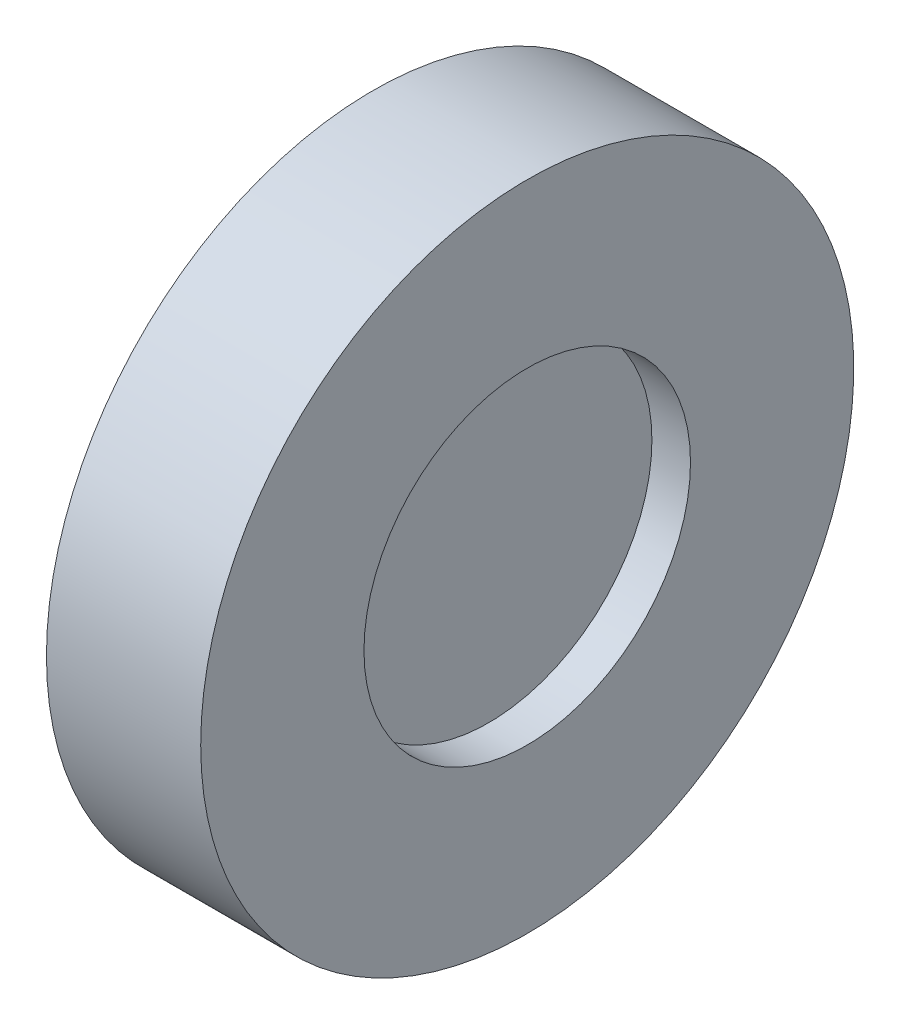
ISO-10303-21;
HEADER;
FILE_DESCRIPTION(('STEP AP214'),'2;1');
FILE_NAME('part.step','',(''),(''),'','','');
FILE_SCHEMA(('AUTOMOTIVE_DESIGN { 1 0 10303 214 1 1 1 1 }'));
ENDSEC;
DATA;
#1=APPLICATION_CONTEXT('core data for automotive mechanical design processes');
#2=APPLICATION_PROTOCOL_DEFINITION('international standard','automotive_design',2000,#1);
#3=PRODUCT_CONTEXT('',#1,'mechanical');
#4=PRODUCT('Part','Part','',(#3));
#5=PRODUCT_RELATED_PRODUCT_CATEGORY('part','',(#4));
#6=PRODUCT_DEFINITION_FORMATION('','',#4);
#7=PRODUCT_DEFINITION_CONTEXT('part definition',#1,'design');
#8=PRODUCT_DEFINITION('design','',#6,#7);
#9=PRODUCT_DEFINITION_SHAPE('','',#8);
#10=(LENGTH_UNIT() NAMED_UNIT(*) SI_UNIT(.MILLI.,.METRE.));
#11=(NAMED_UNIT(*) PLANE_ANGLE_UNIT() SI_UNIT($,.RADIAN.));
#12=(NAMED_UNIT(*) SI_UNIT($,.STERADIAN.) SOLID_ANGLE_UNIT());
#13=UNCERTAINTY_MEASURE_WITH_UNIT(LENGTH_MEASURE(1.E-05),#10,'distance_accuracy_value','');
#14=(GEOMETRIC_REPRESENTATION_CONTEXT(3) GLOBAL_UNCERTAINTY_ASSIGNED_CONTEXT((#13)) GLOBAL_UNIT_ASSIGNED_CONTEXT((#10,
#11,#12)) REPRESENTATION_CONTEXT('',''));
#15=CARTESIAN_POINT('',(0.,0.,0.));
#16=DIRECTION('',(0.,0.,1.));
#17=DIRECTION('',(1.,0.,0.));
#18=AXIS2_PLACEMENT_3D('',#15,#16,#17);
#19=CARTESIAN_POINT('',(1.5,6.35,0.));
#20=DIRECTION('',(-1.,0.,0.));
#21=DIRECTION('',(0.,0.,1.));
#22=AXIS2_PLACEMENT_3D('',#19,#20,#21);
#23=PLANE('',#22);
#24=CARTESIAN_POINT('',(1.5,0.,0.));
#25=DIRECTION('',(-1.,0.,0.));
#26=DIRECTION('',(0.,0.,1.));
#27=AXIS2_PLACEMENT_3D('',#24,#25,#26);
#28=CIRCLE('',#27,6.35);
#29=CARTESIAN_POINT('',(1.5,0.,6.35));
#30=VERTEX_POINT('',#29);
#31=EDGE_CURVE('E10',#30,#30,#28,.T.);
#32=ORIENTED_EDGE('',*,*,#31,.F.);
#33=EDGE_LOOP('',(#32));
#34=FACE_BOUND('',#33,.T.);
#35=ADVANCED_FACE('F37',(#34),#23,.F.);
#36=CARTESIAN_POINT('',(-1.61421241885762,0.,0.));
#37=DIRECTION('',(-1.,0.,0.));
#38=DIRECTION('',(0.,0.,1.));
#39=AXIS2_PLACEMENT_3D('',#36,#37,#38);
#40=CYLINDRICAL_SURFACE('',#39,6.35);
#41=CARTESIAN_POINT('',(3.,0.,0.));
#42=DIRECTION('',(-1.,0.,0.));
#43=DIRECTION('',(0.,0.,1.));
#44=AXIS2_PLACEMENT_3D('',#41,#42,#43);
#45=CIRCLE('',#44,6.35);
#46=CARTESIAN_POINT('',(3.,0.,6.35));
#47=VERTEX_POINT('',#46);
#48=EDGE_CURVE('E60',#47,#47,#45,.T.);
#49=ORIENTED_EDGE('',*,*,#48,.F.);
#50=EDGE_LOOP('',(#49));
#51=FACE_BOUND('',#50,.T.);
#52=ORIENTED_EDGE('',*,*,#31,.T.);
#53=EDGE_LOOP('',(#52));
#54=FACE_BOUND('',#53,.T.);
#55=ADVANCED_FACE('F90',(#51,#54),#40,.F.);
#56=CARTESIAN_POINT('',(-3.,0.,0.));
#57=DIRECTION('',(-1.,0.,0.));
#58=DIRECTION('',(0.,0.,1.));
#59=AXIS2_PLACEMENT_3D('',#56,#57,#58);
#60=CIRCLE('',#59,6.35);
#61=CARTESIAN_POINT('',(-3.,0.,6.35));
#62=VERTEX_POINT('',#61);
#63=EDGE_CURVE('E64',#62,#62,#60,.T.);
#64=ORIENTED_EDGE('',*,*,#63,.T.);
#65=EDGE_LOOP('',(#64));
#66=FACE_BOUND('',#65,.T.);
#67=CARTESIAN_POINT('',(-1.5,0.,0.));
#68=DIRECTION('',(1.,0.,0.));
#69=DIRECTION('',(0.,0.,-1.));
#70=AXIS2_PLACEMENT_3D('',#67,#68,#69);
#71=CIRCLE('',#70,6.35);
#72=CARTESIAN_POINT('',(-1.5,0.,-6.35));
#73=VERTEX_POINT('',#72);
#74=EDGE_CURVE('E44',#73,#73,#71,.T.);
#75=ORIENTED_EDGE('',*,*,#74,.T.);
#76=EDGE_LOOP('',(#75));
#77=FACE_BOUND('',#76,.T.);
#78=ADVANCED_FACE('F69',(#66,#77),#40,.F.);
#79=CARTESIAN_POINT('',(-3.,6.35,0.));
#80=DIRECTION('',(1.,0.,0.));
#81=DIRECTION('',(0.,0.,-1.));
#82=AXIS2_PLACEMENT_3D('',#79,#80,#81);
#83=PLANE('',#82);
#84=ORIENTED_EDGE('',*,*,#63,.F.);
#85=EDGE_LOOP('',(#84));
#86=FACE_BOUND('',#85,.T.);
#87=CARTESIAN_POINT('',(-3.,0.,0.));
#88=DIRECTION('',(-1.,0.,0.));
#89=DIRECTION('',(0.,0.,1.));
#90=AXIS2_PLACEMENT_3D('',#87,#88,#89);
#91=CIRCLE('',#90,12.7);
#92=CARTESIAN_POINT('',(-3.,0.,12.7));
#93=VERTEX_POINT('',#92);
#94=EDGE_CURVE('E49',#93,#93,#91,.T.);
#95=ORIENTED_EDGE('',*,*,#94,.T.);
#96=EDGE_LOOP('',(#95));
#97=FACE_BOUND('',#96,.T.);
#98=ADVANCED_FACE('F71',(#86,#97),#83,.F.);
#99=CARTESIAN_POINT('',(-1.61421241885762,0.,0.));
#100=DIRECTION('',(-1.,0.,0.));
#101=DIRECTION('',(0.,0.,1.));
#102=AXIS2_PLACEMENT_3D('',#99,#100,#101);
#103=CYLINDRICAL_SURFACE('',#102,12.7);
#104=ORIENTED_EDGE('',*,*,#94,.F.);
#105=EDGE_LOOP('',(#104));
#106=FACE_BOUND('',#105,.T.);
#107=CARTESIAN_POINT('',(3.,0.,0.));
#108=DIRECTION('',(-1.,0.,0.));
#109=DIRECTION('',(0.,0.,1.));
#110=AXIS2_PLACEMENT_3D('',#107,#108,#109);
#111=CIRCLE('',#110,12.7);
#112=CARTESIAN_POINT('',(3.,0.,12.7));
#113=VERTEX_POINT('',#112);
#114=EDGE_CURVE('E54',#113,#113,#111,.T.);
#115=ORIENTED_EDGE('',*,*,#114,.T.);
#116=EDGE_LOOP('',(#115));
#117=FACE_BOUND('',#116,.T.);
#118=ADVANCED_FACE('F74',(#106,#117),#103,.T.);
#119=CARTESIAN_POINT('',(3.,12.7,0.));
#120=DIRECTION('',(-1.,0.,0.));
#121=DIRECTION('',(0.,0.,1.));
#122=AXIS2_PLACEMENT_3D('',#119,#120,#121);
#123=PLANE('',#122);
#124=ORIENTED_EDGE('',*,*,#114,.F.);
#125=EDGE_LOOP('',(#124));
#126=FACE_BOUND('',#125,.T.);
#127=ORIENTED_EDGE('',*,*,#48,.T.);
#128=EDGE_LOOP('',(#127));
#129=FACE_BOUND('',#128,.T.);
#130=ADVANCED_FACE('F80',(#126,#129),#123,.F.);
#131=CARTESIAN_POINT('',(-1.5,6.35,0.));
#132=DIRECTION('',(1.,0.,0.));
#133=DIRECTION('',(0.,0.,-1.));
#134=AXIS2_PLACEMENT_3D('',#131,#132,#133);
#135=PLANE('',#134);
#136=ORIENTED_EDGE('',*,*,#74,.F.);
#137=EDGE_LOOP('',(#136));
#138=FACE_BOUND('',#137,.T.);
#139=ADVANCED_FACE('F86',(#138),#135,.F.);
#140=CLOSED_SHELL('',(#35,#55,#78,#98,#118,#130,#139));
#141=MANIFOLD_SOLID_BREP('B2',#140);
#142=ADVANCED_BREP_SHAPE_REPRESENTATION('',(#18,#141),#14);
#143=SHAPE_DEFINITION_REPRESENTATION(#9,#142);
ENDSEC;
END-ISO-10303-21;
